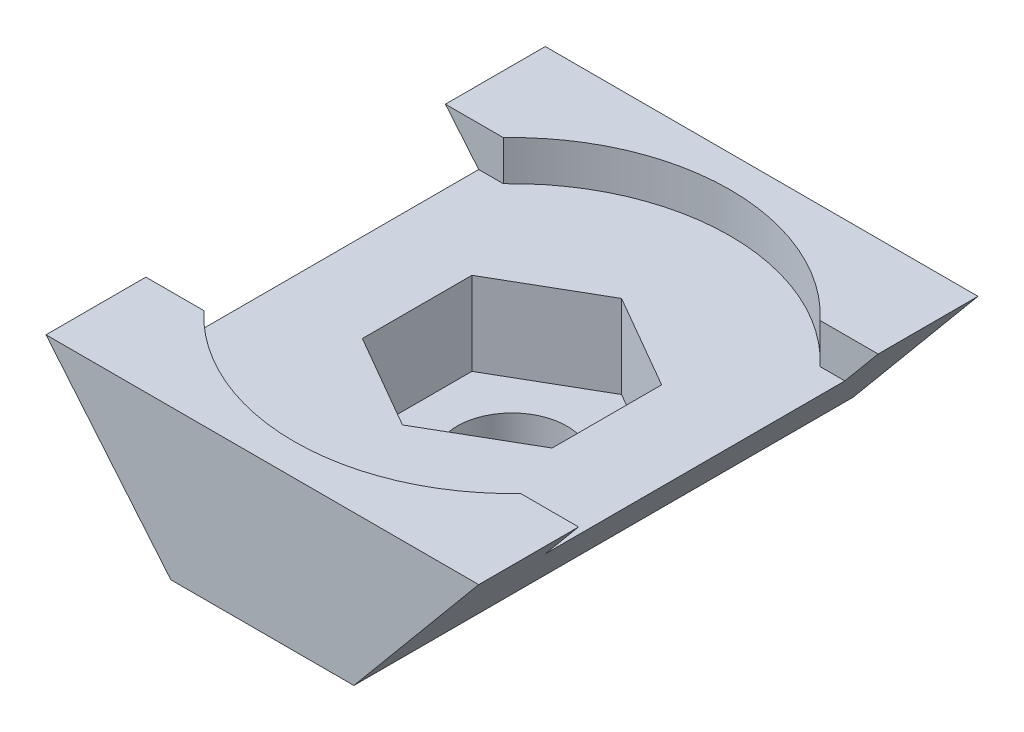
ISO-10303-21;
HEADER;
FILE_DESCRIPTION(('STEP AP214'),'2;1');
FILE_NAME('part.step','',(''),(''),'','','');
FILE_SCHEMA(('AUTOMOTIVE_DESIGN { 1 0 10303 214 1 1 1 1 }'));
ENDSEC;
DATA;
#1=APPLICATION_CONTEXT('core data for automotive mechanical design processes');
#2=APPLICATION_PROTOCOL_DEFINITION('international standard','automotive_design',2000,#1);
#3=PRODUCT_CONTEXT('',#1,'mechanical');
#4=PRODUCT('Part','Part','',(#3));
#5=PRODUCT_RELATED_PRODUCT_CATEGORY('part','',(#4));
#6=PRODUCT_DEFINITION_FORMATION('','',#4);
#7=PRODUCT_DEFINITION_CONTEXT('part definition',#1,'design');
#8=PRODUCT_DEFINITION('design','',#6,#7);
#9=PRODUCT_DEFINITION_SHAPE('','',#8);
#10=(LENGTH_UNIT() NAMED_UNIT(*) SI_UNIT(.MILLI.,.METRE.));
#11=(NAMED_UNIT(*) PLANE_ANGLE_UNIT() SI_UNIT($,.RADIAN.));
#12=(NAMED_UNIT(*) SI_UNIT($,.STERADIAN.) SOLID_ANGLE_UNIT());
#13=UNCERTAINTY_MEASURE_WITH_UNIT(LENGTH_MEASURE(1.E-05),#10,'distance_accuracy_value','');
#14=(GEOMETRIC_REPRESENTATION_CONTEXT(3) GLOBAL_UNCERTAINTY_ASSIGNED_CONTEXT((#13)) GLOBAL_UNIT_ASSIGNED_CONTEXT((#10,
#11,#12)) REPRESENTATION_CONTEXT('',''));
#15=CARTESIAN_POINT('',(0.,0.,0.));
#16=DIRECTION('',(0.,0.,1.));
#17=DIRECTION('',(1.,0.,0.));
#18=AXIS2_PLACEMENT_3D('',#15,#16,#17);
#19=CARTESIAN_POINT('',(0.,-15.,7.5));
#20=DIRECTION('',(0.,1.,0.));
#21=DIRECTION('',(0.,0.,1.));
#22=AXIS2_PLACEMENT_3D('',#19,#20,#21);
#23=CYLINDRICAL_SURFACE('',#22,1.65);
#24=CARTESIAN_POINT('',(0.,-4.5,7.5));
#25=DIRECTION('',(0.,-1.,0.));
#26=DIRECTION('',(1.,0.,0.));
#27=AXIS2_PLACEMENT_3D('',#24,#25,#26);
#28=CIRCLE('',#27,1.65);
#29=CARTESIAN_POINT('',(1.65,-4.5,7.5));
#30=VERTEX_POINT('',#29);
#31=EDGE_CURVE('E270',#30,#30,#28,.T.);
#32=ORIENTED_EDGE('',*,*,#31,.T.);
#33=EDGE_LOOP('',(#32));
#34=FACE_BOUND('',#33,.T.);
#35=CARTESIAN_POINT('',(0.,-3.7,7.5));
#36=DIRECTION('',(0.,1.,0.));
#37=DIRECTION('',(0.,0.,1.));
#38=AXIS2_PLACEMENT_3D('',#35,#36,#37);
#39=CIRCLE('',#38,1.65);
#40=CARTESIAN_POINT('',(0.,-3.7,9.15));
#41=VERTEX_POINT('',#40);
#42=EDGE_CURVE('E37',#41,#41,#39,.F.);
#43=ORIENTED_EDGE('',*,*,#42,.F.);
#44=EDGE_LOOP('',(#43));
#45=FACE_BOUND('',#44,.T.);
#46=ADVANCED_FACE('F33',(#34,#45),#23,.F.);
#47=CARTESIAN_POINT('',(6.5,0.,15.));
#48=DIRECTION('',(0.768221279597376,-0.64018439966448,0.));
#49=DIRECTION('',(0.64018439966448,0.768221279597376,0.));
#50=AXIS2_PLACEMENT_3D('',#47,#48,#49);
#51=PLANE('',#50);
#52=DIRECTION('',(0.,0.,-1.));
#53=VECTOR('',#52,1.);
#54=CARTESIAN_POINT('',(6.5,0.,15.));
#55=LINE('',#54,#53);
#56=CARTESIAN_POINT('',(6.5,0.,3.));
#57=VERTEX_POINT('',#56);
#58=CARTESIAN_POINT('',(6.5,0.,0.));
#59=VERTEX_POINT('',#58);
#60=EDGE_CURVE('E301',#57,#59,#55,.T.);
#61=ORIENTED_EDGE('',*,*,#60,.F.);
#62=DIRECTION('',(-0.64018439966448,-0.768221279597376,0.));
#63=VECTOR('',#62,1.);
#64=CARTESIAN_POINT('',(6.5,0.,3.));
#65=LINE('',#64,#63);
#66=CARTESIAN_POINT('',(5.5,-1.2,3.));
#67=VERTEX_POINT('',#66);
#68=EDGE_CURVE('E262',#57,#67,#65,.T.);
#69=ORIENTED_EDGE('',*,*,#68,.T.);
#70=DIRECTION('',(0.,0.,1.));
#71=VECTOR('',#70,1.);
#72=CARTESIAN_POINT('',(5.5,-1.2,15.));
#73=LINE('',#72,#71);
#74=CARTESIAN_POINT('',(5.5,-1.2,12.));
#75=VERTEX_POINT('',#74);
#76=EDGE_CURVE('E249',#67,#75,#73,.T.);
#77=ORIENTED_EDGE('',*,*,#76,.T.);
#78=DIRECTION('',(-0.64018439966448,-0.768221279597376,0.));
#79=VECTOR('',#78,1.);
#80=CARTESIAN_POINT('',(6.5,0.,12.));
#81=LINE('',#80,#79);
#82=CARTESIAN_POINT('',(6.5,0.,12.));
#83=VERTEX_POINT('',#82);
#84=EDGE_CURVE('E260',#83,#75,#81,.T.);
#85=ORIENTED_EDGE('',*,*,#84,.F.);
#86=CARTESIAN_POINT('',(6.5,0.,15.));
#87=VERTEX_POINT('',#86);
#88=EDGE_CURVE('E299',#87,#83,#55,.T.);
#89=ORIENTED_EDGE('',*,*,#88,.F.);
#90=DIRECTION('',(-0.64018439966448,-0.768221279597376,0.));
#91=VECTOR('',#90,1.);
#92=CARTESIAN_POINT('',(6.5,0.,15.));
#93=LINE('',#92,#91);
#94=CARTESIAN_POINT('',(2.75,-4.5,15.));
#95=VERTEX_POINT('',#94);
#96=EDGE_CURVE('E281',#87,#95,#93,.T.);
#97=ORIENTED_EDGE('',*,*,#96,.T.);
#98=DIRECTION('',(0.,0.,-1.));
#99=VECTOR('',#98,1.);
#100=CARTESIAN_POINT('',(2.75,-4.5,15.));
#101=LINE('',#100,#99);
#102=CARTESIAN_POINT('',(2.75,-4.5,0.));
#103=VERTEX_POINT('',#102);
#104=EDGE_CURVE('E42',#95,#103,#101,.T.);
#105=ORIENTED_EDGE('',*,*,#104,.T.);
#106=DIRECTION('',(-0.64018439966448,-0.768221279597376,0.));
#107=VECTOR('',#106,1.);
#108=CARTESIAN_POINT('',(6.5,0.,0.));
#109=LINE('',#108,#107);
#110=EDGE_CURVE('E293',#59,#103,#109,.T.);
#111=ORIENTED_EDGE('',*,*,#110,.F.);
#112=EDGE_LOOP('',(#61,#69,#77,#85,#89,#97,#105,#111));
#113=FACE_BOUND('',#112,.T.);
#114=ADVANCED_FACE('F346',(#113),#51,.T.);
#115=CARTESIAN_POINT('',(-6.5,0.,15.));
#116=DIRECTION('',(0.,1.,0.));
#117=DIRECTION('',(0.,0.,1.));
#118=AXIS2_PLACEMENT_3D('',#115,#116,#117);
#119=PLANE('',#118);
#120=DIRECTION('',(0.,0.,-1.));
#121=VECTOR('',#120,1.);
#122=CARTESIAN_POINT('',(-6.5,0.,15.));
#123=LINE('',#122,#121);
#124=CARTESIAN_POINT('',(-6.5,0.,3.));
#125=VERTEX_POINT('',#124);
#126=CARTESIAN_POINT('',(-6.5,0.,0.));
#127=VERTEX_POINT('',#126);
#128=EDGE_CURVE('E287',#125,#127,#123,.T.);
#129=ORIENTED_EDGE('',*,*,#128,.F.);
#130=DIRECTION('',(1.,0.,0.));
#131=VECTOR('',#130,1.);
#132=CARTESIAN_POINT('',(-7.81356526518942,0.,3.));
#133=LINE('',#132,#131);
#134=CARTESIAN_POINT('',(-4.7594642555649,0.,3.));
#135=VERTEX_POINT('',#134);
#136=EDGE_CURVE('E219',#125,#135,#133,.T.);
#137=ORIENTED_EDGE('',*,*,#136,.T.);
#138=CARTESIAN_POINT('',(0.,0.,7.5));
#139=DIRECTION('',(0.,1.,0.));
#140=DIRECTION('',(0.,0.,1.));
#141=AXIS2_PLACEMENT_3D('',#138,#139,#140);
#142=CIRCLE('',#141,6.55);
#143=CARTESIAN_POINT('',(4.75946425556491,0.,3.));
#144=VERTEX_POINT('',#143);
#145=EDGE_CURVE('E242',#144,#135,#142,.T.);
#146=ORIENTED_EDGE('',*,*,#145,.F.);
#147=DIRECTION('',(1.,0.,0.));
#148=VECTOR('',#147,1.);
#149=CARTESIAN_POINT('',(4.75946425556491,0.,3.));
#150=LINE('',#149,#148);
#151=EDGE_CURVE('E239',#144,#57,#150,.T.);
#152=ORIENTED_EDGE('',*,*,#151,.T.);
#153=ORIENTED_EDGE('',*,*,#60,.T.);
#154=DIRECTION('',(1.,0.,0.));
#155=VECTOR('',#154,1.);
#156=CARTESIAN_POINT('',(-6.5,0.,0.));
#157=LINE('',#156,#155);
#158=EDGE_CURVE('E290',#127,#59,#157,.T.);
#159=ORIENTED_EDGE('',*,*,#158,.F.);
#160=EDGE_LOOP('',(#129,#137,#146,#152,#153,#159));
#161=FACE_BOUND('',#160,.T.);
#162=ADVANCED_FACE('F310',(#161),#119,.T.);
#163=CARTESIAN_POINT('',(-2.75,-4.5,15.));
#164=DIRECTION('',(-0.768221279597376,-0.64018439966448,0.));
#165=DIRECTION('',(0.64018439966448,-0.768221279597376,0.));
#166=AXIS2_PLACEMENT_3D('',#163,#164,#165);
#167=PLANE('',#166);
#168=DIRECTION('',(-0.64018439966448,0.768221279597376,0.));
#169=VECTOR('',#168,1.);
#170=CARTESIAN_POINT('',(-2.75,-4.5,12.));
#171=LINE('',#170,#169);
#172=CARTESIAN_POINT('',(-5.5,-1.2,12.));
#173=VERTEX_POINT('',#172);
#174=CARTESIAN_POINT('',(-6.5,0.,12.));
#175=VERTEX_POINT('',#174);
#176=EDGE_CURVE('E268',#173,#175,#171,.T.);
#177=ORIENTED_EDGE('',*,*,#176,.F.);
#178=DIRECTION('',(0.,0.,-1.));
#179=VECTOR('',#178,1.);
#180=CARTESIAN_POINT('',(-5.5,-1.2,15.));
#181=LINE('',#180,#179);
#182=CARTESIAN_POINT('',(-5.5,-1.2,3.));
#183=VERTEX_POINT('',#182);
#184=EDGE_CURVE('E257',#173,#183,#181,.T.);
#185=ORIENTED_EDGE('',*,*,#184,.T.);
#186=DIRECTION('',(-0.64018439966448,0.768221279597376,0.));
#187=VECTOR('',#186,1.);
#188=CARTESIAN_POINT('',(-2.75,-4.5,3.));
#189=LINE('',#188,#187);
#190=EDGE_CURVE('E265',#183,#125,#189,.T.);
#191=ORIENTED_EDGE('',*,*,#190,.T.);
#192=ORIENTED_EDGE('',*,*,#128,.T.);
#193=DIRECTION('',(-0.64018439966448,0.768221279597376,0.));
#194=VECTOR('',#193,1.);
#195=CARTESIAN_POINT('',(-2.75,-4.5,0.));
#196=LINE('',#195,#194);
#197=CARTESIAN_POINT('',(-2.75,-4.5,0.));
#198=VERTEX_POINT('',#197);
#199=EDGE_CURVE('E273',#198,#127,#196,.T.);
#200=ORIENTED_EDGE('',*,*,#199,.F.);
#201=DIRECTION('',(0.,0.,-1.));
#202=VECTOR('',#201,1.);
#203=CARTESIAN_POINT('',(-2.75,-4.5,15.));
#204=LINE('',#203,#202);
#205=CARTESIAN_POINT('',(-2.75,-4.5,15.));
#206=VERTEX_POINT('',#205);
#207=EDGE_CURVE('E11',#206,#198,#204,.T.);
#208=ORIENTED_EDGE('',*,*,#207,.F.);
#209=DIRECTION('',(-0.64018439966448,0.768221279597376,0.));
#210=VECTOR('',#209,1.);
#211=CARTESIAN_POINT('',(-2.75,-4.5,15.));
#212=LINE('',#211,#210);
#213=CARTESIAN_POINT('',(-6.5,0.,15.));
#214=VERTEX_POINT('',#213);
#215=EDGE_CURVE('E274',#206,#214,#212,.T.);
#216=ORIENTED_EDGE('',*,*,#215,.T.);
#217=EDGE_CURVE('E302',#214,#175,#123,.T.);
#218=ORIENTED_EDGE('',*,*,#217,.T.);
#219=EDGE_LOOP('',(#177,#185,#191,#192,#200,#208,#216,#218));
#220=FACE_BOUND('',#219,.T.);
#221=ADVANCED_FACE('F35',(#220),#167,.T.);
#222=CARTESIAN_POINT('',(2.75,-4.5,15.));
#223=DIRECTION('',(0.,-1.,0.));
#224=DIRECTION('',(1.,0.,0.));
#225=AXIS2_PLACEMENT_3D('',#222,#223,#224);
#226=PLANE('',#225);
#227=ORIENTED_EDGE('',*,*,#31,.F.);
#228=EDGE_LOOP('',(#227));
#229=FACE_BOUND('',#228,.T.);
#230=DIRECTION('',(-1.,0.,0.));
#231=VECTOR('',#230,1.);
#232=CARTESIAN_POINT('',(2.75,-4.5,0.));
#233=LINE('',#232,#231);
#234=EDGE_CURVE('E278',#103,#198,#233,.T.);
#235=ORIENTED_EDGE('',*,*,#234,.F.);
#236=ORIENTED_EDGE('',*,*,#104,.F.);
#237=DIRECTION('',(-1.,0.,0.));
#238=VECTOR('',#237,1.);
#239=CARTESIAN_POINT('',(2.75,-4.5,15.));
#240=LINE('',#239,#238);
#241=EDGE_CURVE('E284',#95,#206,#240,.T.);
#242=ORIENTED_EDGE('',*,*,#241,.T.);
#243=ORIENTED_EDGE('',*,*,#207,.T.);
#244=EDGE_LOOP('',(#235,#236,#242,#243));
#245=FACE_BOUND('',#244,.T.);
#246=ADVANCED_FACE('F317',(#229,#245),#226,.T.);
#247=DIRECTION('',(1.,0.,0.));
#248=VECTOR('',#247,1.);
#249=CARTESIAN_POINT('',(-7.81356526518942,0.,12.));
#250=LINE('',#249,#248);
#251=CARTESIAN_POINT('',(-4.7594642555649,0.,12.));
#252=VERTEX_POINT('',#251);
#253=EDGE_CURVE('E233',#175,#252,#250,.T.);
#254=ORIENTED_EDGE('',*,*,#253,.F.);
#255=ORIENTED_EDGE('',*,*,#217,.F.);
#256=DIRECTION('',(1.,0.,0.));
#257=VECTOR('',#256,1.);
#258=CARTESIAN_POINT('',(-6.5,0.,15.));
#259=LINE('',#258,#257);
#260=EDGE_CURVE('E277',#214,#87,#259,.T.);
#261=ORIENTED_EDGE('',*,*,#260,.T.);
#262=ORIENTED_EDGE('',*,*,#88,.T.);
#263=DIRECTION('',(1.,0.,0.));
#264=VECTOR('',#263,1.);
#265=CARTESIAN_POINT('',(4.7594642555649,0.,12.));
#266=LINE('',#265,#264);
#267=CARTESIAN_POINT('',(4.7594642555649,0.,12.));
#268=VERTEX_POINT('',#267);
#269=EDGE_CURVE('E237',#268,#83,#266,.T.);
#270=ORIENTED_EDGE('',*,*,#269,.F.);
#271=CARTESIAN_POINT('',(0.,0.,7.5));
#272=DIRECTION('',(0.,1.,0.));
#273=DIRECTION('',(0.,0.,1.));
#274=AXIS2_PLACEMENT_3D('',#271,#272,#273);
#275=CIRCLE('',#274,6.55);
#276=EDGE_CURVE('E235',#252,#268,#275,.T.);
#277=ORIENTED_EDGE('',*,*,#276,.F.);
#278=EDGE_LOOP('',(#254,#255,#261,#262,#270,#277));
#279=FACE_BOUND('',#278,.T.);
#280=ADVANCED_FACE('F326',(#279),#119,.T.);
#281=CARTESIAN_POINT('',(0.,0.,15.));
#282=DIRECTION('',(0.,0.,1.));
#283=DIRECTION('',(1.,0.,0.));
#284=AXIS2_PLACEMENT_3D('',#281,#282,#283);
#285=PLANE('',#284);
#286=ORIENTED_EDGE('',*,*,#215,.F.);
#287=ORIENTED_EDGE('',*,*,#241,.F.);
#288=ORIENTED_EDGE('',*,*,#96,.F.);
#289=ORIENTED_EDGE('',*,*,#260,.F.);
#290=EDGE_LOOP('',(#286,#287,#288,#289));
#291=FACE_BOUND('',#290,.T.);
#292=ADVANCED_FACE('F322',(#291),#285,.T.);
#293=CARTESIAN_POINT('',(0.,0.,0.));
#294=DIRECTION('',(0.,0.,1.));
#295=DIRECTION('',(1.,0.,0.));
#296=AXIS2_PLACEMENT_3D('',#293,#294,#295);
#297=PLANE('',#296);
#298=ORIENTED_EDGE('',*,*,#199,.T.);
#299=ORIENTED_EDGE('',*,*,#158,.T.);
#300=ORIENTED_EDGE('',*,*,#110,.T.);
#301=ORIENTED_EDGE('',*,*,#234,.T.);
#302=EDGE_LOOP('',(#298,#299,#300,#301));
#303=FACE_BOUND('',#302,.T.);
#304=ADVANCED_FACE('F314',(#303),#297,.F.);
#305=CARTESIAN_POINT('',(0.,-1.2,7.5));
#306=DIRECTION('',(0.,1.,0.));
#307=DIRECTION('',(0.,0.,1.));
#308=AXIS2_PLACEMENT_3D('',#305,#306,#307);
#309=PLANE('',#308);
#310=DIRECTION('',(-0.866025403784439,0.,-0.5));
#311=VECTOR('',#310,1.);
#312=CARTESIAN_POINT('',(2.85,-1.2,5.85455173280957));
#313=LINE('',#312,#311);
#314=CARTESIAN_POINT('',(2.85,-1.2,5.85455173280957));
#315=VERTEX_POINT('',#314);
#316=CARTESIAN_POINT('',(0.,-1.2,4.20910346561913));
#317=VERTEX_POINT('',#316);
#318=EDGE_CURVE('E50',#315,#317,#313,.T.);
#319=ORIENTED_EDGE('',*,*,#318,.F.);
#320=DIRECTION('',(0.,0.,-1.));
#321=VECTOR('',#320,1.);
#322=CARTESIAN_POINT('',(2.85,-1.2,9.14544826719043));
#323=LINE('',#322,#321);
#324=CARTESIAN_POINT('',(2.85,-1.2,9.14544826719043));
#325=VERTEX_POINT('',#324);
#326=EDGE_CURVE('E183',#325,#315,#323,.T.);
#327=ORIENTED_EDGE('',*,*,#326,.F.);
#328=DIRECTION('',(0.866025403784439,0.,-0.5));
#329=VECTOR('',#328,1.);
#330=CARTESIAN_POINT('',(0.,-1.2,10.7908965343809));
#331=LINE('',#330,#329);
#332=CARTESIAN_POINT('',(0.,-1.2,10.7908965343809));
#333=VERTEX_POINT('',#332);
#334=EDGE_CURVE('E186',#333,#325,#331,.T.);
#335=ORIENTED_EDGE('',*,*,#334,.F.);
#336=DIRECTION('',(0.866025403784439,0.,0.5));
#337=VECTOR('',#336,1.);
#338=CARTESIAN_POINT('',(-2.85,-1.2,9.14544826719043));
#339=LINE('',#338,#337);
#340=CARTESIAN_POINT('',(-2.85,-1.2,9.14544826719043));
#341=VERTEX_POINT('',#340);
#342=EDGE_CURVE('E202',#341,#333,#339,.T.);
#343=ORIENTED_EDGE('',*,*,#342,.F.);
#344=DIRECTION('',(0.,0.,1.));
#345=VECTOR('',#344,1.);
#346=CARTESIAN_POINT('',(-2.85,-1.2,5.85455173280956));
#347=LINE('',#346,#345);
#348=CARTESIAN_POINT('',(-2.85,-1.2,5.85455173280956));
#349=VERTEX_POINT('',#348);
#350=EDGE_CURVE('E199',#349,#341,#347,.T.);
#351=ORIENTED_EDGE('',*,*,#350,.F.);
#352=DIRECTION('',(-0.866025403784439,0.,0.5));
#353=VECTOR('',#352,1.);
#354=CARTESIAN_POINT('',(0.,-1.2,4.20910346561913));
#355=LINE('',#354,#353);
#356=EDGE_CURVE('E197',#317,#349,#355,.T.);
#357=ORIENTED_EDGE('',*,*,#356,.F.);
#358=EDGE_LOOP('',(#319,#327,#335,#343,#351,#357));
#359=FACE_BOUND('',#358,.T.);
#360=DIRECTION('',(1.,0.,0.));
#361=VECTOR('',#360,1.);
#362=CARTESIAN_POINT('',(-7.81356526518942,-1.2,12.));
#363=LINE('',#362,#361);
#364=CARTESIAN_POINT('',(-4.7594642555649,-1.2,12.));
#365=VERTEX_POINT('',#364);
#366=EDGE_CURVE('E216',#173,#365,#363,.T.);
#367=ORIENTED_EDGE('',*,*,#366,.T.);
#368=CARTESIAN_POINT('',(0.,-1.2,7.5));
#369=DIRECTION('',(0.,1.,0.));
#370=DIRECTION('',(0.,0.,1.));
#371=AXIS2_PLACEMENT_3D('',#368,#369,#370);
#372=CIRCLE('',#371,6.55);
#373=CARTESIAN_POINT('',(4.7594642555649,-1.2,12.));
#374=VERTEX_POINT('',#373);
#375=EDGE_CURVE('E218',#365,#374,#372,.T.);
#376=ORIENTED_EDGE('',*,*,#375,.T.);
#377=DIRECTION('',(1.,0.,0.));
#378=VECTOR('',#377,1.);
#379=CARTESIAN_POINT('',(4.7594642555649,-1.2,12.));
#380=LINE('',#379,#378);
#381=EDGE_CURVE('E222',#374,#75,#380,.T.);
#382=ORIENTED_EDGE('',*,*,#381,.T.);
#383=ORIENTED_EDGE('',*,*,#76,.F.);
#384=DIRECTION('',(1.,0.,0.));
#385=VECTOR('',#384,1.);
#386=CARTESIAN_POINT('',(4.75946425556491,-1.2,3.));
#387=LINE('',#386,#385);
#388=CARTESIAN_POINT('',(4.75946425556491,-1.2,3.));
#389=VERTEX_POINT('',#388);
#390=EDGE_CURVE('E225',#389,#67,#387,.T.);
#391=ORIENTED_EDGE('',*,*,#390,.F.);
#392=CARTESIAN_POINT('',(0.,-1.2,7.5));
#393=DIRECTION('',(0.,1.,0.));
#394=DIRECTION('',(0.,0.,1.));
#395=AXIS2_PLACEMENT_3D('',#392,#393,#394);
#396=CIRCLE('',#395,6.55);
#397=CARTESIAN_POINT('',(-4.7594642555649,-1.2,3.));
#398=VERTEX_POINT('',#397);
#399=EDGE_CURVE('E228',#389,#398,#396,.T.);
#400=ORIENTED_EDGE('',*,*,#399,.T.);
#401=DIRECTION('',(1.,0.,0.));
#402=VECTOR('',#401,1.);
#403=CARTESIAN_POINT('',(-7.81356526518942,-1.2,3.));
#404=LINE('',#403,#402);
#405=EDGE_CURVE('E231',#183,#398,#404,.T.);
#406=ORIENTED_EDGE('',*,*,#405,.F.);
#407=ORIENTED_EDGE('',*,*,#184,.F.);
#408=EDGE_LOOP('',(#367,#376,#382,#383,#391,#400,#406,#407));
#409=FACE_BOUND('',#408,.T.);
#410=ADVANCED_FACE('F334',(#359,#409),#309,.T.);
#411=CARTESIAN_POINT('',(-7.81356526518942,-1.2,12.));
#412=DIRECTION('',(0.,0.,1.));
#413=DIRECTION('',(1.,0.,0.));
#414=AXIS2_PLACEMENT_3D('',#411,#412,#413);
#415=PLANE('',#414);
#416=ORIENTED_EDGE('',*,*,#176,.T.);
#417=ORIENTED_EDGE('',*,*,#253,.T.);
#418=DIRECTION('',(0.,1.,0.));
#419=VECTOR('',#418,1.);
#420=CARTESIAN_POINT('',(-4.7594642555649,-1.2,12.));
#421=LINE('',#420,#419);
#422=EDGE_CURVE('E58',#365,#252,#421,.T.);
#423=ORIENTED_EDGE('',*,*,#422,.F.);
#424=ORIENTED_EDGE('',*,*,#366,.F.);
#425=EDGE_LOOP('',(#416,#417,#423,#424));
#426=FACE_BOUND('',#425,.T.);
#427=ADVANCED_FACE('F330',(#426),#415,.F.);
#428=CARTESIAN_POINT('',(-7.81356526518942,-1.2,3.));
#429=DIRECTION('',(0.,0.,1.));
#430=DIRECTION('',(1.,0.,0.));
#431=AXIS2_PLACEMENT_3D('',#428,#429,#430);
#432=PLANE('',#431);
#433=ORIENTED_EDGE('',*,*,#405,.T.);
#434=DIRECTION('',(0.,1.,0.));
#435=VECTOR('',#434,1.);
#436=CARTESIAN_POINT('',(-4.7594642555649,-1.2,3.));
#437=LINE('',#436,#435);
#438=EDGE_CURVE('E247',#398,#135,#437,.T.);
#439=ORIENTED_EDGE('',*,*,#438,.T.);
#440=ORIENTED_EDGE('',*,*,#136,.F.);
#441=ORIENTED_EDGE('',*,*,#190,.F.);
#442=EDGE_LOOP('',(#433,#439,#440,#441));
#443=FACE_BOUND('',#442,.T.);
#444=ADVANCED_FACE('F339',(#443),#432,.T.);
#445=CARTESIAN_POINT('',(0.,-1.2,7.5));
#446=DIRECTION('',(0.,1.,0.));
#447=DIRECTION('',(0.,0.,1.));
#448=AXIS2_PLACEMENT_3D('',#445,#446,#447);
#449=CYLINDRICAL_SURFACE('',#448,6.55);
#450=ORIENTED_EDGE('',*,*,#145,.T.);
#451=ORIENTED_EDGE('',*,*,#438,.F.);
#452=ORIENTED_EDGE('',*,*,#399,.F.);
#453=DIRECTION('',(0.,1.,0.));
#454=VECTOR('',#453,1.);
#455=CARTESIAN_POINT('',(4.75946425556491,-1.2,3.));
#456=LINE('',#455,#454);
#457=EDGE_CURVE('E250',#389,#144,#456,.T.);
#458=ORIENTED_EDGE('',*,*,#457,.T.);
#459=EDGE_LOOP('',(#450,#451,#452,#458));
#460=FACE_BOUND('',#459,.T.);
#461=ADVANCED_FACE('F341',(#460),#449,.F.);
#462=CARTESIAN_POINT('',(4.75946425556491,-1.2,3.));
#463=DIRECTION('',(0.,0.,1.));
#464=DIRECTION('',(1.,0.,0.));
#465=AXIS2_PLACEMENT_3D('',#462,#463,#464);
#466=PLANE('',#465);
#467=ORIENTED_EDGE('',*,*,#151,.F.);
#468=ORIENTED_EDGE('',*,*,#457,.F.);
#469=ORIENTED_EDGE('',*,*,#390,.T.);
#470=ORIENTED_EDGE('',*,*,#68,.F.);
#471=EDGE_LOOP('',(#467,#468,#469,#470));
#472=FACE_BOUND('',#471,.T.);
#473=ADVANCED_FACE('F359',(#472),#466,.T.);
#474=CARTESIAN_POINT('',(4.7594642555649,-1.2,12.));
#475=DIRECTION('',(0.,0.,1.));
#476=DIRECTION('',(1.,0.,0.));
#477=AXIS2_PLACEMENT_3D('',#474,#475,#476);
#478=PLANE('',#477);
#479=ORIENTED_EDGE('',*,*,#84,.T.);
#480=ORIENTED_EDGE('',*,*,#381,.F.);
#481=DIRECTION('',(0.,1.,0.));
#482=VECTOR('',#481,1.);
#483=CARTESIAN_POINT('',(4.7594642555649,-1.2,12.));
#484=LINE('',#483,#482);
#485=EDGE_CURVE('E252',#374,#268,#484,.T.);
#486=ORIENTED_EDGE('',*,*,#485,.T.);
#487=ORIENTED_EDGE('',*,*,#269,.T.);
#488=EDGE_LOOP('',(#479,#480,#486,#487));
#489=FACE_BOUND('',#488,.T.);
#490=ADVANCED_FACE('F350',(#489),#478,.F.);
#491=CARTESIAN_POINT('',(0.,-1.2,7.5));
#492=DIRECTION('',(0.,1.,0.));
#493=DIRECTION('',(0.,0.,1.));
#494=AXIS2_PLACEMENT_3D('',#491,#492,#493);
#495=CYLINDRICAL_SURFACE('',#494,6.55);
#496=ORIENTED_EDGE('',*,*,#276,.T.);
#497=ORIENTED_EDGE('',*,*,#485,.F.);
#498=ORIENTED_EDGE('',*,*,#375,.F.);
#499=ORIENTED_EDGE('',*,*,#422,.T.);
#500=EDGE_LOOP('',(#496,#497,#498,#499));
#501=FACE_BOUND('',#500,.T.);
#502=ADVANCED_FACE('F351',(#501),#495,.F.);
#503=CARTESIAN_POINT('',(0.,-3.7,0.));
#504=DIRECTION('',(0.,1.,0.));
#505=DIRECTION('',(0.,0.,1.));
#506=AXIS2_PLACEMENT_3D('',#503,#504,#505);
#507=PLANE('',#506);
#508=DIRECTION('',(-0.866025403784439,0.,-0.5));
#509=VECTOR('',#508,1.);
#510=CARTESIAN_POINT('',(2.85,-3.7,5.85455173280957));
#511=LINE('',#510,#509);
#512=CARTESIAN_POINT('',(2.85,-3.7,5.85455173280957));
#513=VERTEX_POINT('',#512);
#514=CARTESIAN_POINT('',(0.,-3.7,4.20910346561913));
#515=VERTEX_POINT('',#514);
#516=EDGE_CURVE('E163',#513,#515,#511,.T.);
#517=ORIENTED_EDGE('',*,*,#516,.T.);
#518=DIRECTION('',(-0.866025403784439,0.,0.5));
#519=VECTOR('',#518,1.);
#520=CARTESIAN_POINT('',(0.,-3.7,4.20910346561913));
#521=LINE('',#520,#519);
#522=CARTESIAN_POINT('',(-2.85,-3.7,5.85455173280956));
#523=VERTEX_POINT('',#522);
#524=EDGE_CURVE('E172',#515,#523,#521,.T.);
#525=ORIENTED_EDGE('',*,*,#524,.T.);
#526=DIRECTION('',(0.,0.,1.));
#527=VECTOR('',#526,1.);
#528=CARTESIAN_POINT('',(-2.85,-3.7,5.85455173280956));
#529=LINE('',#528,#527);
#530=CARTESIAN_POINT('',(-2.85,-3.7,9.14544826719043));
#531=VERTEX_POINT('',#530);
#532=EDGE_CURVE('E177',#523,#531,#529,.T.);
#533=ORIENTED_EDGE('',*,*,#532,.T.);
#534=DIRECTION('',(0.866025403784439,0.,0.5));
#535=VECTOR('',#534,1.);
#536=CARTESIAN_POINT('',(-2.85,-3.7,9.14544826719043));
#537=LINE('',#536,#535);
#538=CARTESIAN_POINT('',(0.,-3.7,10.7908965343809));
#539=VERTEX_POINT('',#538);
#540=EDGE_CURVE('E190',#531,#539,#537,.T.);
#541=ORIENTED_EDGE('',*,*,#540,.T.);
#542=DIRECTION('',(0.866025403784439,0.,-0.5));
#543=VECTOR('',#542,1.);
#544=CARTESIAN_POINT('',(0.,-3.7,10.7908965343809));
#545=LINE('',#544,#543);
#546=CARTESIAN_POINT('',(2.85,-3.7,9.14544826719043));
#547=VERTEX_POINT('',#546);
#548=EDGE_CURVE('E193',#539,#547,#545,.T.);
#549=ORIENTED_EDGE('',*,*,#548,.T.);
#550=DIRECTION('',(0.,0.,-1.));
#551=VECTOR('',#550,1.);
#552=CARTESIAN_POINT('',(2.85,-3.7,9.14544826719043));
#553=LINE('',#552,#551);
#554=EDGE_CURVE('E169',#547,#513,#553,.T.);
#555=ORIENTED_EDGE('',*,*,#554,.T.);
#556=EDGE_LOOP('',(#517,#525,#533,#541,#549,#555));
#557=FACE_BOUND('',#556,.T.);
#558=ORIENTED_EDGE('',*,*,#42,.T.);
#559=EDGE_LOOP('',(#558));
#560=FACE_BOUND('',#559,.T.);
#561=ADVANCED_FACE('F179',(#557,#560),#507,.T.);
#562=CARTESIAN_POINT('',(2.85,-3.7,5.85455173280957));
#563=DIRECTION('',(0.5,0.,-0.866025403784438));
#564=DIRECTION('',(-0.866025403784439,0.,-0.5));
#565=AXIS2_PLACEMENT_3D('',#562,#563,#564);
#566=PLANE('',#565);
#567=ORIENTED_EDGE('',*,*,#318,.T.);
#568=DIRECTION('',(0.,1.,0.));
#569=VECTOR('',#568,1.);
#570=CARTESIAN_POINT('',(0.,-3.7,4.20910346561913));
#571=LINE('',#570,#569);
#572=EDGE_CURVE('E159',#515,#317,#571,.T.);
#573=ORIENTED_EDGE('',*,*,#572,.F.);
#574=ORIENTED_EDGE('',*,*,#516,.F.);
#575=DIRECTION('',(0.,1.,0.));
#576=VECTOR('',#575,1.);
#577=CARTESIAN_POINT('',(2.85,-3.7,5.85455173280957));
#578=LINE('',#577,#576);
#579=EDGE_CURVE('E207',#513,#315,#578,.T.);
#580=ORIENTED_EDGE('',*,*,#579,.T.);
#581=EDGE_LOOP('',(#567,#573,#574,#580));
#582=FACE_BOUND('',#581,.T.);
#583=ADVANCED_FACE('F161',(#582),#566,.F.);
#584=CARTESIAN_POINT('',(2.85,-3.7,9.14544826719043));
#585=DIRECTION('',(1.,0.,0.));
#586=DIRECTION('',(0.,0.,-1.));
#587=AXIS2_PLACEMENT_3D('',#584,#585,#586);
#588=PLANE('',#587);
#589=ORIENTED_EDGE('',*,*,#326,.T.);
#590=ORIENTED_EDGE('',*,*,#579,.F.);
#591=ORIENTED_EDGE('',*,*,#554,.F.);
#592=DIRECTION('',(0.,1.,0.));
#593=VECTOR('',#592,1.);
#594=CARTESIAN_POINT('',(2.85,-3.7,9.14544826719043));
#595=LINE('',#594,#593);
#596=EDGE_CURVE('E209',#547,#325,#595,.T.);
#597=ORIENTED_EDGE('',*,*,#596,.T.);
#598=EDGE_LOOP('',(#589,#590,#591,#597));
#599=FACE_BOUND('',#598,.T.);
#600=ADVANCED_FACE('F483',(#599),#588,.F.);
#601=CARTESIAN_POINT('',(0.,-3.7,10.7908965343809));
#602=DIRECTION('',(0.5,0.,0.866025403784439));
#603=DIRECTION('',(0.866025403784439,0.,-0.5));
#604=AXIS2_PLACEMENT_3D('',#601,#602,#603);
#605=PLANE('',#604);
#606=ORIENTED_EDGE('',*,*,#334,.T.);
#607=ORIENTED_EDGE('',*,*,#596,.F.);
#608=ORIENTED_EDGE('',*,*,#548,.F.);
#609=DIRECTION('',(0.,1.,0.));
#610=VECTOR('',#609,1.);
#611=CARTESIAN_POINT('',(0.,-3.7,10.7908965343809));
#612=LINE('',#611,#610);
#613=EDGE_CURVE('E211',#539,#333,#612,.T.);
#614=ORIENTED_EDGE('',*,*,#613,.T.);
#615=EDGE_LOOP('',(#606,#607,#608,#614));
#616=FACE_BOUND('',#615,.T.);
#617=ADVANCED_FACE('F492',(#616),#605,.F.);
#618=CARTESIAN_POINT('',(-2.85,-3.7,9.14544826719043));
#619=DIRECTION('',(-0.5,0.,0.866025403784438));
#620=DIRECTION('',(0.866025403784439,0.,0.5));
#621=AXIS2_PLACEMENT_3D('',#618,#619,#620);
#622=PLANE('',#621);
#623=ORIENTED_EDGE('',*,*,#342,.T.);
#624=ORIENTED_EDGE('',*,*,#613,.F.);
#625=ORIENTED_EDGE('',*,*,#540,.F.);
#626=DIRECTION('',(0.,1.,0.));
#627=VECTOR('',#626,1.);
#628=CARTESIAN_POINT('',(-2.85,-3.7,9.14544826719043));
#629=LINE('',#628,#627);
#630=EDGE_CURVE('E213',#531,#341,#629,.T.);
#631=ORIENTED_EDGE('',*,*,#630,.T.);
#632=EDGE_LOOP('',(#623,#624,#625,#631));
#633=FACE_BOUND('',#632,.T.);
#634=ADVANCED_FACE('F502',(#633),#622,.F.);
#635=CARTESIAN_POINT('',(-2.85,-3.7,5.85455173280956));
#636=DIRECTION('',(-1.,0.,0.));
#637=DIRECTION('',(0.,0.,1.));
#638=AXIS2_PLACEMENT_3D('',#635,#636,#637);
#639=PLANE('',#638);
#640=ORIENTED_EDGE('',*,*,#350,.T.);
#641=ORIENTED_EDGE('',*,*,#630,.F.);
#642=ORIENTED_EDGE('',*,*,#532,.F.);
#643=DIRECTION('',(0.,1.,0.));
#644=VECTOR('',#643,1.);
#645=CARTESIAN_POINT('',(-2.85,-3.7,5.85455173280956));
#646=LINE('',#645,#644);
#647=EDGE_CURVE('E168',#523,#349,#646,.T.);
#648=ORIENTED_EDGE('',*,*,#647,.T.);
#649=EDGE_LOOP('',(#640,#641,#642,#648));
#650=FACE_BOUND('',#649,.T.);
#651=ADVANCED_FACE('F512',(#650),#639,.F.);
#652=CARTESIAN_POINT('',(0.,-3.7,4.20910346561913));
#653=DIRECTION('',(-0.5,0.,-0.866025403784439));
#654=DIRECTION('',(-0.866025403784439,0.,0.5));
#655=AXIS2_PLACEMENT_3D('',#652,#653,#654);
#656=PLANE('',#655);
#657=ORIENTED_EDGE('',*,*,#356,.T.);
#658=ORIENTED_EDGE('',*,*,#647,.F.);
#659=ORIENTED_EDGE('',*,*,#524,.F.);
#660=ORIENTED_EDGE('',*,*,#572,.T.);
#661=EDGE_LOOP('',(#657,#658,#659,#660));
#662=FACE_BOUND('',#661,.T.);
#663=ADVANCED_FACE('F173',(#662),#656,.F.);
#664=CLOSED_SHELL('',(#46,#114,#162,#221,#246,#280,#292,#304,#410,#427,#444,#461,#473,#490,#502,
#561,#583,#600,#617,#634,#651,#663));
#665=MANIFOLD_SOLID_BREP('B2',#664);
#666=ADVANCED_BREP_SHAPE_REPRESENTATION('',(#18,#665),#14);
#667=SHAPE_DEFINITION_REPRESENTATION(#9,#666);
ENDSEC;
END-ISO-10303-21;
